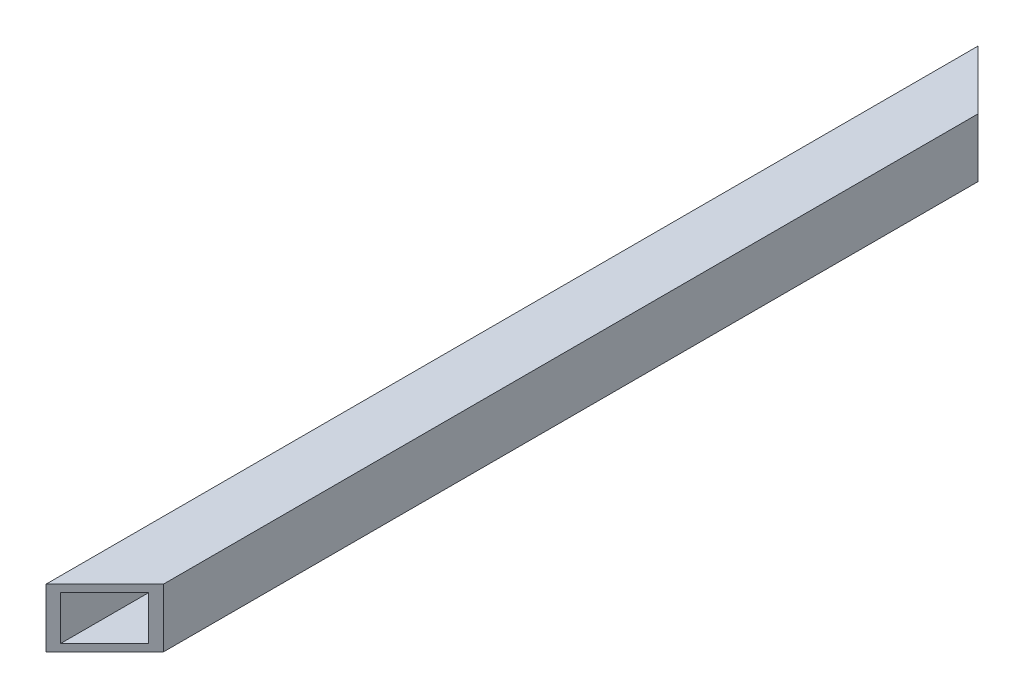
ISO-10303-21;
HEADER;
FILE_DESCRIPTION(('STEP AP214'),'2;1');
FILE_NAME('part.step','',(''),(''),'','','');
FILE_SCHEMA(('AUTOMOTIVE_DESIGN { 1 0 10303 214 1 1 1 1 }'));
ENDSEC;
DATA;
#1=APPLICATION_CONTEXT('core data for automotive mechanical design processes');
#2=APPLICATION_PROTOCOL_DEFINITION('international standard','automotive_design',2000,#1);
#3=PRODUCT_CONTEXT('',#1,'mechanical');
#4=PRODUCT('Part','Part','',(#3));
#5=PRODUCT_RELATED_PRODUCT_CATEGORY('part','',(#4));
#6=PRODUCT_DEFINITION_FORMATION('','',#4);
#7=PRODUCT_DEFINITION_CONTEXT('part definition',#1,'design');
#8=PRODUCT_DEFINITION('design','',#6,#7);
#9=PRODUCT_DEFINITION_SHAPE('','',#8);
#10=(LENGTH_UNIT() NAMED_UNIT(*) SI_UNIT(.MILLI.,.METRE.));
#11=(NAMED_UNIT(*) PLANE_ANGLE_UNIT() SI_UNIT($,.RADIAN.));
#12=(NAMED_UNIT(*) SI_UNIT($,.STERADIAN.) SOLID_ANGLE_UNIT());
#13=UNCERTAINTY_MEASURE_WITH_UNIT(LENGTH_MEASURE(1.E-05),#10,'distance_accuracy_value','');
#14=(GEOMETRIC_REPRESENTATION_CONTEXT(3) GLOBAL_UNCERTAINTY_ASSIGNED_CONTEXT((#13)) GLOBAL_UNIT_ASSIGNED_CONTEXT((#10,
#11,#12)) REPRESENTATION_CONTEXT('',''));
#15=CARTESIAN_POINT('',(0.,0.,0.));
#16=DIRECTION('',(0.,0.,1.));
#17=DIRECTION('',(1.,0.,0.));
#18=AXIS2_PLACEMENT_3D('',#15,#16,#17);
#19=CARTESIAN_POINT('',(-12.7,12.7,-201.6125));
#20=DIRECTION('',(-0.707106781186546,0.,0.707106781186549));
#21=DIRECTION('',(0.707106781186549,0.,0.707106781186546));
#22=AXIS2_PLACEMENT_3D('',#19,#20,#21);
#23=PLANE('',#22);
#24=DIRECTION('',(0.707106781186549,0.,0.707106781186546));
#25=VECTOR('',#24,1.);
#26=CARTESIAN_POINT('',(44.053125,-12.7,-144.859375));
#27=LINE('',#26,#25);
#28=CARTESIAN_POINT('',(-12.7,-12.7,-201.6125));
#29=VERTEX_POINT('',#28);
#30=CARTESIAN_POINT('',(12.7,-12.7,-176.2125));
#31=VERTEX_POINT('',#30);
#32=EDGE_CURVE('E10',#29,#31,#27,.T.);
#33=ORIENTED_EDGE('',*,*,#32,.F.);
#34=DIRECTION('',(0.,-1.,0.));
#35=VECTOR('',#34,1.);
#36=CARTESIAN_POINT('',(-12.7,-12.7,-201.6125));
#37=LINE('',#36,#35);
#38=CARTESIAN_POINT('',(-12.7,12.7,-201.6125));
#39=VERTEX_POINT('',#38);
#40=EDGE_CURVE('E35',#39,#29,#37,.T.);
#41=ORIENTED_EDGE('',*,*,#40,.F.);
#42=DIRECTION('',(-0.707106781186549,0.,-0.707106781186546));
#43=VECTOR('',#42,1.);
#44=CARTESIAN_POINT('',(37.703125,12.7,-151.209375));
#45=LINE('',#44,#43);
#46=CARTESIAN_POINT('',(12.7,12.7,-176.2125));
#47=VERTEX_POINT('',#46);
#48=EDGE_CURVE('E140',#47,#39,#45,.T.);
#49=ORIENTED_EDGE('',*,*,#48,.F.);
#50=DIRECTION('',(0.,1.,0.));
#51=VECTOR('',#50,1.);
#52=CARTESIAN_POINT('',(12.7,12.7,-176.2125));
#53=LINE('',#52,#51);
#54=EDGE_CURVE('E111',#31,#47,#53,.T.);
#55=ORIENTED_EDGE('',*,*,#54,.F.);
#56=EDGE_LOOP('',(#33,#41,#49,#55));
#57=FACE_BOUND('',#56,.T.);
#58=DIRECTION('',(0.,1.,0.));
#59=VECTOR('',#58,1.);
#60=CARTESIAN_POINT('',(-9.52500000000001,1.5875,-198.4375));
#61=LINE('',#60,#59);
#62=CARTESIAN_POINT('',(-9.525,-9.525,-198.4375));
#63=VERTEX_POINT('',#62);
#64=CARTESIAN_POINT('',(-9.525,9.525,-198.4375));
#65=VERTEX_POINT('',#64);
#66=EDGE_CURVE('E103',#63,#65,#61,.T.);
#67=ORIENTED_EDGE('',*,*,#66,.F.);
#68=DIRECTION('',(-0.707106781186549,0.,-0.707106781186546));
#69=VECTOR('',#68,1.);
#70=CARTESIAN_POINT('',(43.259375,-9.525,-145.653125));
#71=LINE('',#70,#69);
#72=CARTESIAN_POINT('',(9.525,-9.525,-179.3875));
#73=VERTEX_POINT('',#72);
#74=EDGE_CURVE('E113',#73,#63,#71,.T.);
#75=ORIENTED_EDGE('',*,*,#74,.F.);
#76=DIRECTION('',(0.,-1.,0.));
#77=VECTOR('',#76,1.);
#78=CARTESIAN_POINT('',(9.52500000000001,11.1125,-179.3875));
#79=LINE('',#78,#77);
#80=CARTESIAN_POINT('',(9.525,9.525,-179.3875));
#81=VERTEX_POINT('',#80);
#82=EDGE_CURVE('E117',#81,#73,#79,.T.);
#83=ORIENTED_EDGE('',*,*,#82,.F.);
#84=DIRECTION('',(0.707106781186549,0.,0.707106781186546));
#85=VECTOR('',#84,1.);
#86=CARTESIAN_POINT('',(38.496875,9.525,-150.415625));
#87=LINE('',#86,#85);
#88=EDGE_CURVE('E90',#65,#81,#87,.T.);
#89=ORIENTED_EDGE('',*,*,#88,.F.);
#90=EDGE_LOOP('',(#67,#75,#83,#89));
#91=FACE_BOUND('',#90,.T.);
#92=ADVANCED_FACE('F16',(#57,#91),#23,.F.);
#93=CARTESIAN_POINT('',(12.7,-12.7,0.));
#94=DIRECTION('',(0.,-1.,0.));
#95=DIRECTION('',(0.,0.,-1.));
#96=AXIS2_PLACEMENT_3D('',#93,#94,#95);
#97=PLANE('',#96);
#98=ORIENTED_EDGE('',*,*,#32,.T.);
#99=DIRECTION('',(0.,0.,-1.));
#100=VECTOR('',#99,1.);
#101=CARTESIAN_POINT('',(12.7,-12.7,0.));
#102=LINE('',#101,#100);
#103=CARTESIAN_POINT('',(12.7,-12.7,176.2125));
#104=VERTEX_POINT('',#103);
#105=EDGE_CURVE('E120',#104,#31,#102,.T.);
#106=ORIENTED_EDGE('',*,*,#105,.F.);
#107=DIRECTION('',(-0.707106781186547,0.,0.707106781186548));
#108=VECTOR('',#107,1.);
#109=CARTESIAN_POINT('',(56.753125,-12.7,132.159375));
#110=LINE('',#109,#108);
#111=CARTESIAN_POINT('',(-12.7,-12.7,201.6125));
#112=VERTEX_POINT('',#111);
#113=EDGE_CURVE('E26',#104,#112,#110,.T.);
#114=ORIENTED_EDGE('',*,*,#113,.T.);
#115=DIRECTION('',(0.,0.,-1.));
#116=VECTOR('',#115,1.);
#117=CARTESIAN_POINT('',(-12.7,-12.7,0.));
#118=LINE('',#117,#116);
#119=EDGE_CURVE('E128',#112,#29,#118,.T.);
#120=ORIENTED_EDGE('',*,*,#119,.T.);
#121=EDGE_LOOP('',(#98,#106,#114,#120));
#122=FACE_BOUND('',#121,.T.);
#123=ADVANCED_FACE('F157',(#122),#97,.T.);
#124=CARTESIAN_POINT('',(12.7,12.7,0.));
#125=DIRECTION('',(1.,0.,0.));
#126=DIRECTION('',(0.,0.,-1.));
#127=AXIS2_PLACEMENT_3D('',#124,#125,#126);
#128=PLANE('',#127);
#129=ORIENTED_EDGE('',*,*,#54,.T.);
#130=DIRECTION('',(0.,0.,-1.));
#131=VECTOR('',#130,1.);
#132=CARTESIAN_POINT('',(12.7,12.7,0.));
#133=LINE('',#132,#131);
#134=CARTESIAN_POINT('',(12.7,12.7,176.2125));
#135=VERTEX_POINT('',#134);
#136=EDGE_CURVE('E104',#135,#47,#133,.T.);
#137=ORIENTED_EDGE('',*,*,#136,.F.);
#138=DIRECTION('',(0.,-1.,0.));
#139=VECTOR('',#138,1.);
#140=CARTESIAN_POINT('',(12.7,12.7,176.2125));
#141=LINE('',#140,#139);
#142=EDGE_CURVE('E125',#135,#104,#141,.T.);
#143=ORIENTED_EDGE('',*,*,#142,.T.);
#144=ORIENTED_EDGE('',*,*,#105,.T.);
#145=EDGE_LOOP('',(#129,#137,#143,#144));
#146=FACE_BOUND('',#145,.T.);
#147=ADVANCED_FACE('F162',(#146),#128,.T.);
#148=CARTESIAN_POINT('',(9.525,9.525,0.));
#149=DIRECTION('',(1.,0.,0.));
#150=DIRECTION('',(0.,0.,-1.));
#151=AXIS2_PLACEMENT_3D('',#148,#149,#150);
#152=PLANE('',#151);
#153=ORIENTED_EDGE('',*,*,#82,.T.);
#154=DIRECTION('',(0.,0.,1.));
#155=VECTOR('',#154,1.);
#156=CARTESIAN_POINT('',(9.525,-9.525,0.));
#157=LINE('',#156,#155);
#158=CARTESIAN_POINT('',(9.525,-9.525,179.3875));
#159=VERTEX_POINT('',#158);
#160=EDGE_CURVE('E121',#73,#159,#157,.T.);
#161=ORIENTED_EDGE('',*,*,#160,.T.);
#162=DIRECTION('',(0.,1.,0.));
#163=VECTOR('',#162,1.);
#164=CARTESIAN_POINT('',(9.52500000000001,11.1125,179.3875));
#165=LINE('',#164,#163);
#166=CARTESIAN_POINT('',(9.525,9.525,179.3875));
#167=VERTEX_POINT('',#166);
#168=EDGE_CURVE('E135',#159,#167,#165,.T.);
#169=ORIENTED_EDGE('',*,*,#168,.T.);
#170=DIRECTION('',(0.,0.,-1.));
#171=VECTOR('',#170,1.);
#172=CARTESIAN_POINT('',(9.525,9.525,0.));
#173=LINE('',#172,#171);
#174=EDGE_CURVE('E87',#167,#81,#173,.T.);
#175=ORIENTED_EDGE('',*,*,#174,.T.);
#176=EDGE_LOOP('',(#153,#161,#169,#175));
#177=FACE_BOUND('',#176,.T.);
#178=ADVANCED_FACE('F169',(#177),#152,.F.);
#179=CARTESIAN_POINT('',(9.525,-9.525,0.));
#180=DIRECTION('',(0.,-1.,0.));
#181=DIRECTION('',(0.,0.,-1.));
#182=AXIS2_PLACEMENT_3D('',#179,#180,#181);
#183=PLANE('',#182);
#184=ORIENTED_EDGE('',*,*,#74,.T.);
#185=DIRECTION('',(0.,0.,1.));
#186=VECTOR('',#185,1.);
#187=CARTESIAN_POINT('',(-9.525,-9.525,0.));
#188=LINE('',#187,#186);
#189=CARTESIAN_POINT('',(-9.525,-9.525,198.4375));
#190=VERTEX_POINT('',#189);
#191=EDGE_CURVE('E116',#63,#190,#188,.T.);
#192=ORIENTED_EDGE('',*,*,#191,.T.);
#193=DIRECTION('',(0.707106781186547,0.,-0.707106781186548));
#194=VECTOR('',#193,1.);
#195=CARTESIAN_POINT('',(55.959375,-9.525,132.953125));
#196=LINE('',#195,#194);
#197=EDGE_CURVE('E96',#190,#159,#196,.T.);
#198=ORIENTED_EDGE('',*,*,#197,.T.);
#199=ORIENTED_EDGE('',*,*,#160,.F.);
#200=EDGE_LOOP('',(#184,#192,#198,#199));
#201=FACE_BOUND('',#200,.T.);
#202=ADVANCED_FACE('F173',(#201),#183,.F.);
#203=CARTESIAN_POINT('',(12.7,12.7,176.2125));
#204=DIRECTION('',(-0.707106781186548,0.,-0.707106781186547));
#205=DIRECTION('',(-0.707106781186547,0.,0.707106781186548));
#206=AXIS2_PLACEMENT_3D('',#203,#204,#205);
#207=PLANE('',#206);
#208=ORIENTED_EDGE('',*,*,#113,.F.);
#209=ORIENTED_EDGE('',*,*,#142,.F.);
#210=DIRECTION('',(0.707106781186547,0.,-0.707106781186548));
#211=VECTOR('',#210,1.);
#212=CARTESIAN_POINT('',(50.403125,12.7,138.509375));
#213=LINE('',#212,#211);
#214=CARTESIAN_POINT('',(-12.7,12.7,201.6125));
#215=VERTEX_POINT('',#214);
#216=EDGE_CURVE('E107',#215,#135,#213,.T.);
#217=ORIENTED_EDGE('',*,*,#216,.F.);
#218=DIRECTION('',(0.,1.,0.));
#219=VECTOR('',#218,1.);
#220=CARTESIAN_POINT('',(-12.7,-12.7,201.6125));
#221=LINE('',#220,#219);
#222=EDGE_CURVE('E76',#112,#215,#221,.T.);
#223=ORIENTED_EDGE('',*,*,#222,.F.);
#224=EDGE_LOOP('',(#208,#209,#217,#223));
#225=FACE_BOUND('',#224,.T.);
#226=ORIENTED_EDGE('',*,*,#168,.F.);
#227=ORIENTED_EDGE('',*,*,#197,.F.);
#228=DIRECTION('',(0.,-1.,0.));
#229=VECTOR('',#228,1.);
#230=CARTESIAN_POINT('',(-9.525,1.5875,198.4375));
#231=LINE('',#230,#229);
#232=CARTESIAN_POINT('',(-9.525,9.525,198.4375));
#233=VERTEX_POINT('',#232);
#234=EDGE_CURVE('E93',#233,#190,#231,.T.);
#235=ORIENTED_EDGE('',*,*,#234,.F.);
#236=DIRECTION('',(-0.707106781186547,0.,0.707106781186548));
#237=VECTOR('',#236,1.);
#238=CARTESIAN_POINT('',(51.196875,9.525,137.715625));
#239=LINE('',#238,#237);
#240=EDGE_CURVE('E82',#167,#233,#239,.T.);
#241=ORIENTED_EDGE('',*,*,#240,.F.);
#242=EDGE_LOOP('',(#226,#227,#235,#241));
#243=FACE_BOUND('',#242,.T.);
#244=ADVANCED_FACE('F94',(#225,#243),#207,.F.);
#245=CARTESIAN_POINT('',(-12.7,12.7,0.));
#246=DIRECTION('',(0.,1.,0.));
#247=DIRECTION('',(0.,0.,1.));
#248=AXIS2_PLACEMENT_3D('',#245,#246,#247);
#249=PLANE('',#248);
#250=ORIENTED_EDGE('',*,*,#48,.T.);
#251=DIRECTION('',(0.,0.,1.));
#252=VECTOR('',#251,1.);
#253=CARTESIAN_POINT('',(-12.7,12.7,0.));
#254=LINE('',#253,#252);
#255=EDGE_CURVE('E143',#39,#215,#254,.T.);
#256=ORIENTED_EDGE('',*,*,#255,.T.);
#257=ORIENTED_EDGE('',*,*,#216,.T.);
#258=ORIENTED_EDGE('',*,*,#136,.T.);
#259=EDGE_LOOP('',(#250,#256,#257,#258));
#260=FACE_BOUND('',#259,.T.);
#261=ADVANCED_FACE('F148',(#260),#249,.T.);
#262=CARTESIAN_POINT('',(-9.525,-9.525,0.));
#263=DIRECTION('',(-1.,0.,0.));
#264=DIRECTION('',(0.,0.,1.));
#265=AXIS2_PLACEMENT_3D('',#262,#263,#264);
#266=PLANE('',#265);
#267=ORIENTED_EDGE('',*,*,#66,.T.);
#268=DIRECTION('',(0.,0.,1.));
#269=VECTOR('',#268,1.);
#270=CARTESIAN_POINT('',(-9.525,9.525,0.));
#271=LINE('',#270,#269);
#272=EDGE_CURVE('E20',#65,#233,#271,.T.);
#273=ORIENTED_EDGE('',*,*,#272,.T.);
#274=ORIENTED_EDGE('',*,*,#234,.T.);
#275=ORIENTED_EDGE('',*,*,#191,.F.);
#276=EDGE_LOOP('',(#267,#273,#274,#275));
#277=FACE_BOUND('',#276,.T.);
#278=ADVANCED_FACE('F102',(#277),#266,.F.);
#279=CARTESIAN_POINT('',(-9.525,9.525,0.));
#280=DIRECTION('',(0.,1.,0.));
#281=DIRECTION('',(0.,0.,1.));
#282=AXIS2_PLACEMENT_3D('',#279,#280,#281);
#283=PLANE('',#282);
#284=ORIENTED_EDGE('',*,*,#88,.T.);
#285=ORIENTED_EDGE('',*,*,#174,.F.);
#286=ORIENTED_EDGE('',*,*,#240,.T.);
#287=ORIENTED_EDGE('',*,*,#272,.F.);
#288=EDGE_LOOP('',(#284,#285,#286,#287));
#289=FACE_BOUND('',#288,.T.);
#290=ADVANCED_FACE('F84',(#289),#283,.F.);
#291=CARTESIAN_POINT('',(-12.7,-12.7,0.));
#292=DIRECTION('',(-1.,0.,0.));
#293=DIRECTION('',(0.,0.,1.));
#294=AXIS2_PLACEMENT_3D('',#291,#292,#293);
#295=PLANE('',#294);
#296=ORIENTED_EDGE('',*,*,#222,.T.);
#297=ORIENTED_EDGE('',*,*,#255,.F.);
#298=ORIENTED_EDGE('',*,*,#40,.T.);
#299=ORIENTED_EDGE('',*,*,#119,.F.);
#300=EDGE_LOOP('',(#296,#297,#298,#299));
#301=FACE_BOUND('',#300,.T.);
#302=ADVANCED_FACE('F18',(#301),#295,.T.);
#303=CLOSED_SHELL('',(#92,#123,#147,#178,#202,#244,#261,#278,#290,#302));
#304=MANIFOLD_SOLID_BREP('B1',#303);
#305=ADVANCED_BREP_SHAPE_REPRESENTATION('',(#18,#304),#14);
#306=SHAPE_DEFINITION_REPRESENTATION(#9,#305);
ENDSEC;
END-ISO-10303-21;
